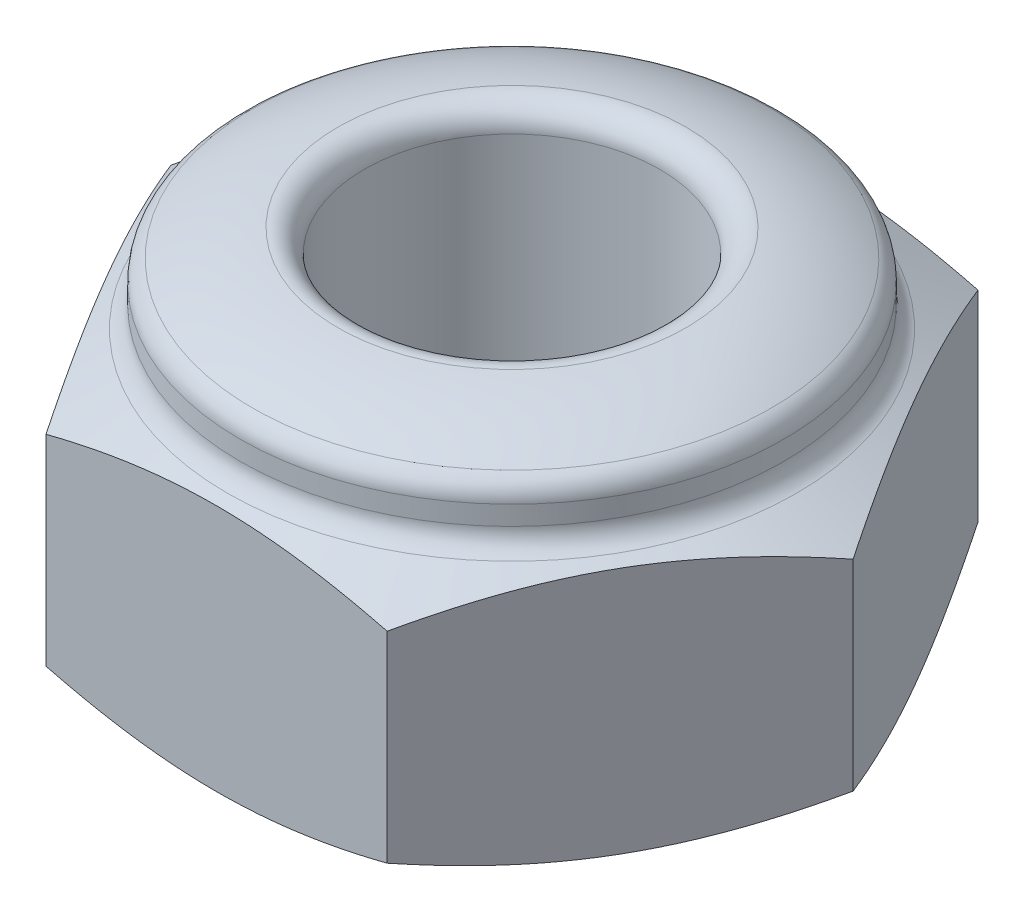
ISO-10303-21;
HEADER;
FILE_DESCRIPTION(('STEP AP214'),'2;1');
FILE_NAME('part.step','',(''),(''),'','','');
FILE_SCHEMA(('AUTOMOTIVE_DESIGN { 1 0 10303 214 1 1 1 1 }'));
ENDSEC;
DATA;
#1=APPLICATION_CONTEXT('core data for automotive mechanical design processes');
#2=APPLICATION_PROTOCOL_DEFINITION('international standard','automotive_design',2000,#1);
#3=PRODUCT_CONTEXT('',#1,'mechanical');
#4=PRODUCT('Part','Part','',(#3));
#5=PRODUCT_RELATED_PRODUCT_CATEGORY('part','',(#4));
#6=PRODUCT_DEFINITION_FORMATION('','',#4);
#7=PRODUCT_DEFINITION_CONTEXT('part definition',#1,'design');
#8=PRODUCT_DEFINITION('design','',#6,#7);
#9=PRODUCT_DEFINITION_SHAPE('','',#8);
#10=(LENGTH_UNIT() NAMED_UNIT(*) SI_UNIT(.MILLI.,.METRE.));
#11=(NAMED_UNIT(*) PLANE_ANGLE_UNIT() SI_UNIT($,.RADIAN.));
#12=(NAMED_UNIT(*) SI_UNIT($,.STERADIAN.) SOLID_ANGLE_UNIT());
#13=UNCERTAINTY_MEASURE_WITH_UNIT(LENGTH_MEASURE(1.E-05),#10,'distance_accuracy_value','');
#14=(GEOMETRIC_REPRESENTATION_CONTEXT(3) GLOBAL_UNCERTAINTY_ASSIGNED_CONTEXT((#13)) GLOBAL_UNIT_ASSIGNED_CONTEXT((#10,
#11,#12)) REPRESENTATION_CONTEXT('',''));
#15=CARTESIAN_POINT('',(0.,0.,0.));
#16=DIRECTION('',(0.,0.,1.));
#17=DIRECTION('',(1.,0.,0.));
#18=AXIS2_PLACEMENT_3D('',#15,#16,#17);
#19=CARTESIAN_POINT('',(0.,-1.15,0.));
#20=DIRECTION('',(0.,1.,0.));
#21=DIRECTION('',(0.,0.,1.));
#22=AXIS2_PLACEMENT_3D('',#19,#20,#21);
#23=PLANE('',#22);
#24=CARTESIAN_POINT('',(0.,-1.15,0.));
#25=DIRECTION('',(0.,1.,0.));
#26=DIRECTION('',(0.,0.,1.));
#27=AXIS2_PLACEMENT_3D('',#24,#25,#26);
#28=CIRCLE('',#27,1.25);
#29=CARTESIAN_POINT('',(0.,-1.15,1.25));
#30=VERTEX_POINT('',#29);
#31=EDGE_CURVE('E233',#30,#30,#28,.T.);
#32=ORIENTED_EDGE('',*,*,#31,.T.);
#33=EDGE_LOOP('',(#32));
#34=FACE_BOUND('',#33,.T.);
#35=CARTESIAN_POINT('',(0.,-1.15,0.));
#36=DIRECTION('',(0.,1.,0.));
#37=DIRECTION('',(0.,0.,1.));
#38=AXIS2_PLACEMENT_3D('',#35,#36,#37);
#39=CIRCLE('',#38,2.30000000000003);
#40=CARTESIAN_POINT('',(0.,-1.15,2.30000000000003));
#41=VERTEX_POINT('',#40);
#42=EDGE_CURVE('E236',#41,#41,#39,.T.);
#43=ORIENTED_EDGE('',*,*,#42,.F.);
#44=EDGE_LOOP('',(#43));
#45=FACE_BOUND('',#44,.T.);
#46=ADVANCED_FACE('F33',(#34,#45),#23,.F.);
#47=CARTESIAN_POINT('',(1.44337567297409,1.15,2.49999999999999));
#48=DIRECTION('',(-0.866025403784441,0.,-0.499999999999995));
#49=DIRECTION('',(-0.499999999999995,0.,0.866025403784442));
#50=AXIS2_PLACEMENT_3D('',#47,#48,#49);
#51=PLANE('',#50);
#52=DIRECTION('',(0.,-1.,0.));
#53=VECTOR('',#52,1.);
#54=CARTESIAN_POINT('',(1.44337567297409,1.15,2.49999999999999));
#55=LINE('',#54,#53);
#56=CARTESIAN_POINT('',(1.44337567297417,0.85,2.49999999999999));
#57=VERTEX_POINT('',#56);
#58=CARTESIAN_POINT('',(1.44337567297409,-0.850000000000019,2.49999999999999));
#59=VERTEX_POINT('',#58);
#60=EDGE_CURVE('E100',#57,#59,#55,.T.);
#61=ORIENTED_EDGE('',*,*,#60,.T.);
#62=CARTESIAN_POINT('',(1.44326020292026,-0.849940957792842,2.50019999999999));
#63=CARTESIAN_POINT('',(1.48304200436103,-0.870275913021248,2.43129589868794));
#64=CARTESIAN_POINT('',(1.52297171977333,-0.88943828497677,2.36213560286208));
#65=CARTESIAN_POINT('',(1.60315528144172,-0.925022276588077,2.22325360012059));
#66=CARTESIAN_POINT('',(1.64340928110925,-0.941442508167529,2.15353162748857));
#67=CARTESIAN_POINT('',(1.7647467778341,-0.98600599889985,1.9433689182979));
#68=CARTESIAN_POINT('',(1.84630037490682,-1.00939599507613,1.80211394462795));
#69=CARTESIAN_POINT('',(1.96821494245454,-1.03261787149011,1.5909517194525));
#70=CARTESIAN_POINT('',(2.008307412772,-1.03838013773711,1.52150952386173));
#71=CARTESIAN_POINT('',(2.08858324859441,-1.0460025287005,1.38246769759725));
#72=CARTESIAN_POINT('',(2.12876660075624,-1.0478631931826,1.31286809003452));
#73=CARTESIAN_POINT('',(2.20908795497129,-1.04760865942046,1.17374742360132));
#74=CARTESIAN_POINT('',(2.24922596105515,-1.04549755958155,1.10422635774957));
#75=CARTESIAN_POINT('',(2.32939940188051,-1.03738839638708,0.965361884822419));
#76=CARTESIAN_POINT('',(2.3694348448531,-1.03139065542793,0.896018463490371));
#77=CARTESIAN_POINT('',(2.44942482862501,-1.01570084263161,0.757471747500809));
#78=CARTESIAN_POINT('',(2.48937890672737,-1.0059994399089,0.688269254257944));
#79=CARTESIAN_POINT('',(2.56904987868748,-0.983213414244998,0.550275082934642));
#80=CARTESIAN_POINT('',(2.60876673138533,-0.970128220698126,0.481483476145227));
#81=CARTESIAN_POINT('',(2.68840407449965,-0.940762434342736,0.343547551691429));
#82=CARTESIAN_POINT('',(2.72832109885332,-0.924444659193758,0.274409237423899));
#83=CARTESIAN_POINT('',(2.80783255799786,-0.889116076286036,0.136691350401629));
#84=CARTESIAN_POINT('',(2.84742716860096,-0.870106856989903,0.0681114731311524));
#85=CARTESIAN_POINT('',(2.88686681600197,-0.849940957792858,-0.00020000000000055));
#86=B_SPLINE_CURVE_WITH_KNOTS('',3,(#62,#63,#64,#65,#66,#67,#68,#69,#70,#71,#72,#73,#74,#75,#76,
#77,#78,#79,#80,#81,#82,#83,#84,#85),.UNSPECIFIED.,.F.,.F.,(4,2,2,2,2,2,2,2,2,2,2,4),(0.,
0.246339561475915,0.492803444956308,0.986384137280997,1.22748103973818,1.46854458552913,
1.70935951780852,1.9501544770742,2.19156013413322,2.43300652579168,2.6774108286129,
2.9216714831912),.UNSPECIFIED.);
#87=CARTESIAN_POINT('',(2.88675134594818,-0.85,0.));
#88=VERTEX_POINT('',#87);
#89=EDGE_CURVE('E48',#59,#88,#86,.T.);
#90=ORIENTED_EDGE('',*,*,#89,.T.);
#91=DIRECTION('',(0.,-1.,0.));
#92=VECTOR('',#91,1.);
#93=CARTESIAN_POINT('',(2.88675134594813,1.15,0.));
#94=LINE('',#93,#92);
#95=CARTESIAN_POINT('',(2.88675134594818,0.85,0.));
#96=VERTEX_POINT('',#95);
#97=EDGE_CURVE('E98',#96,#88,#94,.T.);
#98=ORIENTED_EDGE('',*,*,#97,.F.);
#99=CARTESIAN_POINT('',(2.88686681600197,0.849940957792849,-0.00019999999999984));
#100=CARTESIAN_POINT('',(2.84708501456119,0.870275913021254,0.0687041013120405));
#101=CARTESIAN_POINT('',(2.8071552991489,0.889438284976776,0.137864397137907));
#102=CARTESIAN_POINT('',(2.72697173748051,0.925022276588082,0.27674639987939));
#103=CARTESIAN_POINT('',(2.68671773781298,0.941442508167534,0.346468372511408));
#104=CARTESIAN_POINT('',(2.56538024108813,0.986005998899853,0.556631081702078));
#105=CARTESIAN_POINT('',(2.48382664401541,1.00939599507613,0.697886055372031));
#106=CARTESIAN_POINT('',(2.36191207646768,1.03261787149011,0.909048280547479));
#107=CARTESIAN_POINT('',(2.32181960615023,1.03838013773711,0.978490476138252));
#108=CARTESIAN_POINT('',(2.24154377032782,1.0460025287005,1.11753230240273));
#109=CARTESIAN_POINT('',(2.20136041816599,1.0478631931826,1.18713190996545));
#110=CARTESIAN_POINT('',(2.12103906395094,1.04760865942046,1.32625257639866));
#111=CARTESIAN_POINT('',(2.08090105786708,1.04549755958155,1.39577364225041));
#112=CARTESIAN_POINT('',(2.00072761704172,1.03738839638707,1.53463811517756));
#113=CARTESIAN_POINT('',(1.96069217406913,1.03139065542793,1.6039815365096));
#114=CARTESIAN_POINT('',(1.88070219029722,1.01570084263161,1.74252825249917));
#115=CARTESIAN_POINT('',(1.84074811219486,1.0059994399089,1.81173074574203));
#116=CARTESIAN_POINT('',(1.76107714023475,0.983213414244995,1.94972491706534));
#117=CARTESIAN_POINT('',(1.7213602875369,0.970128220698123,2.01851652385475));
#118=CARTESIAN_POINT('',(1.64172294442258,0.940762434342732,2.15645244830855));
#119=CARTESIAN_POINT('',(1.6018059200689,0.924444659193753,2.22559076257608));
#120=CARTESIAN_POINT('',(1.52229446092437,0.88911607628603,2.36330864959836));
#121=CARTESIAN_POINT('',(1.48269985032127,0.870106856989896,2.43188852686883));
#122=CARTESIAN_POINT('',(1.44326020292026,0.849940957792851,2.50019999999999));
#123=B_SPLINE_CURVE_WITH_KNOTS('',3,(#99,#100,#101,#102,#103,#104,#105,#106,#107,#108,#109,#110,
#111,#112,#113,#114,#115,#116,#117,#118,#119,#120,#121,#122),.UNSPECIFIED.,.F.,.F.,(4,2,2,2,2,2,
2,2,2,2,2,4),(0.,0.246339561475913,0.492803444956304,0.98638413728099,1.22748103973818,
1.46854458552912,1.70935951780851,1.95015447707418,2.19156013413321,2.43300652579167,
2.6774108286129,2.9216714831912),.UNSPECIFIED.);
#124=EDGE_CURVE('E169',#96,#57,#123,.T.);
#125=ORIENTED_EDGE('',*,*,#124,.T.);
#126=EDGE_LOOP('',(#61,#90,#98,#125));
#127=FACE_BOUND('',#126,.T.);
#128=ADVANCED_FACE('F96',(#127),#51,.F.);
#129=CARTESIAN_POINT('',(2.88675134594813,1.15,0.));
#130=DIRECTION('',(-0.866025403784438,0.,0.500000000000001));
#131=DIRECTION('',(0.500000000000001,0.,0.866025403784438));
#132=AXIS2_PLACEMENT_3D('',#129,#130,#131);
#133=PLANE('',#132);
#134=ORIENTED_EDGE('',*,*,#97,.T.);
#135=CARTESIAN_POINT('',(2.88686681600197,-0.849940957792849,0.000200000000000056));
#136=CARTESIAN_POINT('',(2.84708501456119,-0.870275913021255,-0.0687041013120404));
#137=CARTESIAN_POINT('',(2.80715529914889,-0.889438284976777,-0.137864397137907));
#138=CARTESIAN_POINT('',(2.7269717374805,-0.925022276588083,-0.27674639987939));
#139=CARTESIAN_POINT('',(2.68671773781298,-0.941442508167536,-0.346468372511408));
#140=CARTESIAN_POINT('',(2.56538024108812,-0.986005998899856,-0.556631081702077));
#141=CARTESIAN_POINT('',(2.4838266440154,-1.00939599507614,-0.69788605537203));
#142=CARTESIAN_POINT('',(2.36191207646768,-1.03261787149012,-0.909048280547477));
#143=CARTESIAN_POINT('',(2.32181960615023,-1.03838013773711,-0.97849047613825));
#144=CARTESIAN_POINT('',(2.24154377032781,-1.0460025287005,-1.11753230240273));
#145=CARTESIAN_POINT('',(2.20136041816598,-1.0478631931826,-1.18713190996545));
#146=CARTESIAN_POINT('',(2.12103906395093,-1.04760865942047,-1.32625257639865));
#147=CARTESIAN_POINT('',(2.08090105786707,-1.04549755958156,-1.39577364225041));
#148=CARTESIAN_POINT('',(2.00072761704171,-1.03738839638708,-1.53463811517755));
#149=CARTESIAN_POINT('',(1.96069217406912,-1.03139065542794,-1.6039815365096));
#150=CARTESIAN_POINT('',(1.88070219029721,-1.01570084263161,-1.74252825249916));
#151=CARTESIAN_POINT('',(1.84074811219484,-1.00599943990891,-1.81173074574203));
#152=CARTESIAN_POINT('',(1.76107714023473,-0.983213414245,-1.94972491706534));
#153=CARTESIAN_POINT('',(1.72136028753688,-0.970128220698128,-2.01851652385476));
#154=CARTESIAN_POINT('',(1.64172294442255,-0.940762434342736,-2.15645244830856));
#155=CARTESIAN_POINT('',(1.60180592006888,-0.924444659193756,-2.2255907625761));
#156=CARTESIAN_POINT('',(1.52229446092434,-0.889116076286032,-2.36330864959837));
#157=CARTESIAN_POINT('',(1.48269985032123,-0.870106856989897,-2.43188852686885));
#158=CARTESIAN_POINT('',(1.44326020292022,-0.849940957792851,-2.50020000000001));
#159=B_SPLINE_CURVE_WITH_KNOTS('',3,(#135,#136,#137,#138,#139,#140,#141,#142,#143,#144,#145,
#146,#147,#148,#149,#150,#151,#152,#153,#154,#155,#156,#157,#158),.UNSPECIFIED.,.F.,.F.,(4,2,2,
2,2,2,2,2,2,2,2,4),(0.,0.246339561475914,0.492803444956306,0.986384137280993,1.22748103973818,
1.46854458552913,1.70935951780852,1.95015447707419,2.19156013413323,2.43300652579169,
2.67741082861292,2.92167148319123),.UNSPECIFIED.);
#160=CARTESIAN_POINT('',(1.44337567297414,-0.85,-2.50000000000001));
#161=VERTEX_POINT('',#160);
#162=EDGE_CURVE('E84',#88,#161,#159,.T.);
#163=ORIENTED_EDGE('',*,*,#162,.T.);
#164=DIRECTION('',(0.,-1.,0.));
#165=VECTOR('',#164,1.);
#166=CARTESIAN_POINT('',(1.44337567297406,1.15,-2.50000000000001));
#167=LINE('',#166,#165);
#168=CARTESIAN_POINT('',(1.44337567297414,0.85,-2.50000000000001));
#169=VERTEX_POINT('',#168);
#170=EDGE_CURVE('E106',#169,#161,#167,.T.);
#171=ORIENTED_EDGE('',*,*,#170,.F.);
#172=CARTESIAN_POINT('',(1.44326020292022,0.849940957792842,-2.50020000000001));
#173=CARTESIAN_POINT('',(1.483042004361,0.870275913021248,-2.43129589868796));
#174=CARTESIAN_POINT('',(1.5229717197733,0.889438284976771,-2.3621356028621));
#175=CARTESIAN_POINT('',(1.60315528144169,0.925022276588078,-2.22325360012061));
#176=CARTESIAN_POINT('',(1.64340928110921,0.941442508167531,-2.1535316274886));
#177=CARTESIAN_POINT('',(1.76474677783407,0.986005998899852,-1.94336891829792));
#178=CARTESIAN_POINT('',(1.84630037490679,1.00939599507613,-1.80211394462797));
#179=CARTESIAN_POINT('',(1.96821494245452,1.03261787149012,-1.59095171945252));
#180=CARTESIAN_POINT('',(2.00830741277197,1.03838013773711,-1.52150952386175));
#181=CARTESIAN_POINT('',(2.08858324859438,1.0460025287005,-1.38246769759727));
#182=CARTESIAN_POINT('',(2.12876660075621,1.0478631931826,-1.31286809003455));
#183=CARTESIAN_POINT('',(2.20908795497126,1.04760865942047,-1.17374742360134));
#184=CARTESIAN_POINT('',(2.24922596105513,1.04549755958156,-1.10422635774959));
#185=CARTESIAN_POINT('',(2.32939940188049,1.03738839638708,-0.965361884822442));
#186=CARTESIAN_POINT('',(2.36943484485308,1.03139065542794,-0.896018463490393));
#187=CARTESIAN_POINT('',(2.44942482862499,1.01570084263161,-0.75747174750083));
#188=CARTESIAN_POINT('',(2.48937890672735,1.00599943990891,-0.688269254257963));
#189=CARTESIAN_POINT('',(2.56904987868746,0.983213414245003,-0.550275082934656));
#190=CARTESIAN_POINT('',(2.60876673138532,0.970128220698131,-0.481483476145239));
#191=CARTESIAN_POINT('',(2.68840407449964,0.94076243434274,-0.343547551691438));
#192=CARTESIAN_POINT('',(2.72832109885332,0.924444659193761,-0.274409237423906));
#193=CARTESIAN_POINT('',(2.80783255799785,0.889116076286038,-0.136691350401632));
#194=CARTESIAN_POINT('',(2.84742716860096,0.870106856989903,-0.0681114731311541));
#195=CARTESIAN_POINT('',(2.88686681600197,0.849940957792858,0.000200000000000967));
#196=B_SPLINE_CURVE_WITH_KNOTS('',3,(#172,#173,#174,#175,#176,#177,#178,#179,#180,#181,#182,
#183,#184,#185,#186,#187,#188,#189,#190,#191,#192,#193,#194,#195),.UNSPECIFIED.,.F.,.F.,(4,2,2,
2,2,2,2,2,2,2,2,4),(0.,0.246339561475916,0.492803444956309,0.986384137281,1.22748103973819,
1.46854458552914,1.70935951780853,1.9501544770742,2.19156013413324,2.4330065257917,
2.67741082861293,2.92167148319123),.UNSPECIFIED.);
#197=EDGE_CURVE('E104',#169,#96,#196,.T.);
#198=ORIENTED_EDGE('',*,*,#197,.T.);
#199=EDGE_LOOP('',(#134,#163,#171,#198));
#200=FACE_BOUND('',#199,.T.);
#201=ADVANCED_FACE('F103',(#200),#133,.F.);
#202=CARTESIAN_POINT('',(1.44337567297406,1.15,-2.50000000000001));
#203=DIRECTION('',(0.,0.,1.));
#204=DIRECTION('',(1.,0.,0.));
#205=AXIS2_PLACEMENT_3D('',#202,#203,#204);
#206=PLANE('',#205);
#207=ORIENTED_EDGE('',*,*,#170,.T.);
#208=CARTESIAN_POINT('',(4.34587361311277,0.237458154811676,-2.50000000000002));
#209=CARTESIAN_POINT('',(4.22613575360741,0.184404104682634,-2.50000000000001));
#210=CARTESIAN_POINT('',(4.1062025547838,0.13178444358232,-2.50000000000001));
#211=CARTESIAN_POINT('',(3.86583750401857,0.0276642732761254,-2.50000000000001));
#212=CARTESIAN_POINT('',(3.74540560322869,-0.023836123054455,-2.50000000000001));
#213=CARTESIAN_POINT('',(3.50360609912637,-0.125605239165463,-2.50000000000001));
#214=CARTESIAN_POINT('',(3.38223678932978,-0.175869916174756,-2.50000000000001));
#215=CARTESIAN_POINT('',(3.13879002351803,-0.274648468388736,-2.50000000000001));
#216=CARTESIAN_POINT('',(3.01671258916653,-0.323162396829636,-2.50000000000001));
#217=CARTESIAN_POINT('',(2.77143659534895,-0.418066296864358,-2.50000000000001));
#218=CARTESIAN_POINT('',(2.64823622181114,-0.464451601579476,-2.50000000000001));
#219=CARTESIAN_POINT('',(2.40079325665039,-0.554347350801867,-2.50000000000001));
#220=CARTESIAN_POINT('',(2.27655072122877,-0.597857949226153,-2.50000000000001));
#221=CARTESIAN_POINT('',(2.0268930920685,-0.681126486381562,-2.50000000000001));
#222=CARTESIAN_POINT('',(1.90147883876774,-0.720886917245262,-2.50000000000001));
#223=CARTESIAN_POINT('',(1.64923272914206,-0.795561558144086,-2.50000000000001));
#224=CARTESIAN_POINT('',(1.52240109352089,-0.830476511624052,-2.50000000000001));
#225=CARTESIAN_POINT('',(1.2279112141293,-0.903829645269126,-2.5));
#226=CARTESIAN_POINT('',(1.05967649430544,-0.940057046103863,-2.5));
#227=CARTESIAN_POINT('',(0.805529635896037,-0.983646986111996,-2.5));
#228=CARTESIAN_POINT('',(0.720530950577388,-0.996383728491125,-2.5));
#229=CARTESIAN_POINT('',(0.550033961713094,-1.01785212074504,-2.5));
#230=CARTESIAN_POINT('',(0.464535739119156,-1.02658440227139,-2.5));
#231=CARTESIAN_POINT('',(0.293370556151716,-1.03969684893678,-2.5));
#232=CARTESIAN_POINT('',(0.207704250443258,-1.04408547196346,-2.5));
#233=CARTESIAN_POINT('',(0.0362589448771357,-1.04835730536555,-2.5));
#234=CARTESIAN_POINT('',(-0.0495200535257338,-1.04824057334186,-2.5));
#235=CARTESIAN_POINT('',(-0.220939893356359,-1.04350621120751,-2.5));
#236=CARTESIAN_POINT('',(-0.306580753705786,-1.03888926136928,-2.5));
#237=CARTESIAN_POINT('',(-0.477525824997255,-1.02535045311828,-2.5));
#238=CARTESIAN_POINT('',(-0.562829987274483,-1.01642799383534,-2.5));
#239=CARTESIAN_POINT('',(-0.807043784518116,-0.985097564079737,-2.5));
#240=CARTESIAN_POINT('',(-0.965323989872185,-0.957713331320902,-2.5));
#241=CARTESIAN_POINT('',(-1.27958845813876,-0.891920978802273,-2.5));
#242=CARTESIAN_POINT('',(-1.43557113320953,-0.853505579534545,-2.5));
#243=CARTESIAN_POINT('',(-1.74604098127096,-0.768300675878605,-2.49999999999999));
#244=CARTESIAN_POINT('',(-1.90051660451126,-0.721469811212012,-2.49999999999999));
#245=CARTESIAN_POINT('',(-2.20746583561587,-0.621840584460346,-2.49999999999999));
#246=CARTESIAN_POINT('',(-2.35993986726562,-0.569043509076389,-2.49999999999999));
#247=CARTESIAN_POINT('',(-2.66794333182038,-0.457430195575799,-2.49999999999999));
#248=CARTESIAN_POINT('',(-2.82342352420293,-0.398479223604534,-2.49999999999999));
#249=CARTESIAN_POINT('',(-3.13307330231513,-0.277214585109686,-2.49999999999999));
#250=CARTESIAN_POINT('',(-3.28724277773182,-0.214900638730755,-2.49999999999999));
#251=CARTESIAN_POINT('',(-3.59261725095966,-0.0885892425457314,-2.49999999999999));
#252=CARTESIAN_POINT('',(-3.74383514731852,-0.0246228195387622,-2.49999999999999));
#253=CARTESIAN_POINT('',(-4.04542645331375,0.105162342831155,-2.49999999999999));
#254=CARTESIAN_POINT('',(-4.19580008175662,0.170980572904022,-2.49999999999999));
#255=CARTESIAN_POINT('',(-4.34587361311278,0.237458154811699,-2.49999999999999));
#256=B_SPLINE_CURVE_WITH_KNOTS('',3,(#208,#209,#210,#211,#212,#213,#214,#215,#216,#217,#218,
#219,#220,#221,#222,#223,#224,#225,#226,#227,#228,#229,#230,#231,#232,#233,#234,#235,#236,#237,
#238,#239,#240,#241,#242,#243,#244,#245,#246,#247,#248,#249,#250,#251,#252,#253,#254,#255),
.UNSPECIFIED.,.F.,.F.,(4,2,2,2,2,2,2,2,2,2,2,2,2,2,2,2,2,2,2,2,2,2,2,4),(0.,0.392898697877062,
0.785836836535172,1.17992419086486,1.57399955179503,1.9689012219793,2.3637817312452,
2.75839795034677,3.15295355612053,3.66867539781896,3.92643992380949,4.18416377680482,
4.44138480178148,4.69860253819164,4.95578139848303,5.21299616063957,5.69432918948238,
6.17598058462,6.66006737935727,7.14404997218841,7.64283974963129,8.14167109886691,
8.63422918349652,9.1266531024332),.UNSPECIFIED.);
#257=CARTESIAN_POINT('',(-1.44337567297407,-0.85,-2.50000000000002));
#258=VERTEX_POINT('',#257);
#259=EDGE_CURVE('E87',#161,#258,#256,.T.);
#260=ORIENTED_EDGE('',*,*,#259,.T.);
#261=DIRECTION('',(0.,-1.,0.));
#262=VECTOR('',#261,1.);
#263=CARTESIAN_POINT('',(-1.44337567297408,1.15,-2.5));
#264=LINE('',#263,#262);
#265=CARTESIAN_POINT('',(-1.44337567297407,0.85,-2.50000000000002));
#266=VERTEX_POINT('',#265);
#267=EDGE_CURVE('E110',#266,#258,#264,.T.);
#268=ORIENTED_EDGE('',*,*,#267,.F.);
#269=CARTESIAN_POINT('',(-4.34587361311278,-0.2374581548117,-2.49999999999999));
#270=CARTESIAN_POINT('',(-4.22613575360743,-0.184404104682657,-2.49999999999999));
#271=CARTESIAN_POINT('',(-4.10620255478381,-0.131784443582342,-2.49999999999999));
#272=CARTESIAN_POINT('',(-3.86583750401859,-0.027664273276146,-2.49999999999999));
#273=CARTESIAN_POINT('',(-3.7454056032287,0.0238361230544352,-2.49999999999999));
#274=CARTESIAN_POINT('',(-3.50360609912638,0.125605239165444,-2.49999999999999));
#275=CARTESIAN_POINT('',(-3.38223678932979,0.175869916174738,-2.49999999999999));
#276=CARTESIAN_POINT('',(-3.13879002351804,0.274648468388719,-2.49999999999999));
#277=CARTESIAN_POINT('',(-3.01671258916654,0.32316239682962,-2.49999999999999));
#278=CARTESIAN_POINT('',(-2.77143659534896,0.418066296864343,-2.49999999999999));
#279=CARTESIAN_POINT('',(-2.64823622181114,0.464451601579462,-2.49999999999999));
#280=CARTESIAN_POINT('',(-2.40079325665039,0.554347350801855,-2.49999999999999));
#281=CARTESIAN_POINT('',(-2.27655072122877,0.597857949226141,-2.49999999999999));
#282=CARTESIAN_POINT('',(-2.0268930920685,0.681126486381552,-2.49999999999999));
#283=CARTESIAN_POINT('',(-1.90147883876773,0.720886917245252,-2.49999999999999));
#284=CARTESIAN_POINT('',(-1.64923272914205,0.795561558144078,-2.49999999999999));
#285=CARTESIAN_POINT('',(-1.52240109352088,0.830476511624044,-2.49999999999999));
#286=CARTESIAN_POINT('',(-1.22791121412929,0.90382964526912,-2.5));
#287=CARTESIAN_POINT('',(-1.05967649430544,0.940057046103858,-2.5));
#288=CARTESIAN_POINT('',(-0.805529635896028,0.983646986111992,-2.5));
#289=CARTESIAN_POINT('',(-0.720530950577378,0.996383728491121,-2.5));
#290=CARTESIAN_POINT('',(-0.550033961713084,1.01785212074504,-2.5));
#291=CARTESIAN_POINT('',(-0.464535739119146,1.02658440227138,-2.5));
#292=CARTESIAN_POINT('',(-0.293370556151706,1.03969684893678,-2.5));
#293=CARTESIAN_POINT('',(-0.207704250443248,1.04408547196346,-2.5));
#294=CARTESIAN_POINT('',(-0.0362589448771249,1.04835730536555,-2.5));
#295=CARTESIAN_POINT('',(0.0495200535257452,1.04824057334186,-2.5));
#296=CARTESIAN_POINT('',(0.220939893356371,1.04350621120751,-2.5));
#297=CARTESIAN_POINT('',(0.306580753705797,1.03888926136928,-2.5));
#298=CARTESIAN_POINT('',(0.477525824997267,1.02535045311829,-2.5));
#299=CARTESIAN_POINT('',(0.562829987274496,1.01642799383534,-2.5));
#300=CARTESIAN_POINT('',(0.807043784518127,0.98509756407974,-2.5));
#301=CARTESIAN_POINT('',(0.965323989872195,0.957713331320907,-2.5));
#302=CARTESIAN_POINT('',(1.27958845813877,0.891920978802278,-2.5));
#303=CARTESIAN_POINT('',(1.43557113320954,0.853505579534552,-2.50000000000001));
#304=CARTESIAN_POINT('',(1.74604098127096,0.768300675878613,-2.50000000000001));
#305=CARTESIAN_POINT('',(1.90051660451126,0.721469811212021,-2.50000000000001));
#306=CARTESIAN_POINT('',(2.20746583561587,0.621840584460357,-2.50000000000001));
#307=CARTESIAN_POINT('',(2.35993986726562,0.569043509076401,-2.50000000000001));
#308=CARTESIAN_POINT('',(2.66794333182038,0.457430195575813,-2.50000000000001));
#309=CARTESIAN_POINT('',(2.82342352420292,0.398479223604548,-2.50000000000001));
#310=CARTESIAN_POINT('',(3.13307330231512,0.277214585109702,-2.50000000000001));
#311=CARTESIAN_POINT('',(3.28724277773182,0.214900638730772,-2.50000000000001));
#312=CARTESIAN_POINT('',(3.59261725095965,0.0885892425457498,-2.50000000000001));
#313=CARTESIAN_POINT('',(3.74383514731851,0.0246228195387814,-2.50000000000001));
#314=CARTESIAN_POINT('',(4.04542645331373,-0.105162342831134,-2.50000000000001));
#315=CARTESIAN_POINT('',(4.19580008175661,-0.170980572904,-2.50000000000001));
#316=CARTESIAN_POINT('',(4.34587361311277,-0.237458154811677,-2.50000000000002));
#317=B_SPLINE_CURVE_WITH_KNOTS('',3,(#269,#270,#271,#272,#273,#274,#275,#276,#277,#278,#279,
#280,#281,#282,#283,#284,#285,#286,#287,#288,#289,#290,#291,#292,#293,#294,#295,#296,#297,#298,
#299,#300,#301,#302,#303,#304,#305,#306,#307,#308,#309,#310,#311,#312,#313,#314,#315,#316),
.UNSPECIFIED.,.F.,.F.,(4,2,2,2,2,2,2,2,2,2,2,2,2,2,2,2,2,2,2,2,2,2,2,4),(0.,0.392898697877065,
0.785836836535179,1.17992419086487,1.57399955179504,1.96890122197932,2.36378173124523,
2.7583979503468,3.15295355612056,3.66867539781899,3.92643992380953,4.18416377680485,
4.44138480178152,4.69860253819167,4.95578139848306,5.21299616063961,5.69432918948241,
6.17598058462002,6.66006737935729,7.14404997218843,7.6428397496313,8.14167109886692,
8.63422918349653,9.1266531024332),.UNSPECIFIED.);
#318=EDGE_CURVE('E157',#266,#169,#317,.T.);
#319=ORIENTED_EDGE('',*,*,#318,.T.);
#320=EDGE_LOOP('',(#207,#260,#268,#319));
#321=FACE_BOUND('',#320,.T.);
#322=ADVANCED_FACE('F178',(#321),#206,.F.);
#323=CARTESIAN_POINT('',(-1.44337567297408,1.15,-2.5));
#324=DIRECTION('',(0.866025403784442,0.,0.499999999999995));
#325=DIRECTION('',(0.499999999999995,0.,-0.866025403784442));
#326=AXIS2_PLACEMENT_3D('',#323,#324,#325);
#327=PLANE('',#326);
#328=ORIENTED_EDGE('',*,*,#267,.T.);
#329=CARTESIAN_POINT('',(-1.44326020292024,-0.849940957792829,-2.5002));
#330=CARTESIAN_POINT('',(-1.48304200436101,-0.870275913021235,-2.43129589868795));
#331=CARTESIAN_POINT('',(-1.52297171977331,-0.889438284976756,-2.36213560286209));
#332=CARTESIAN_POINT('',(-1.6031552814417,-0.925022276588063,-2.2232536001206));
#333=CARTESIAN_POINT('',(-1.64340928110923,-0.941442508167515,-2.15353162748858));
#334=CARTESIAN_POINT('',(-1.76474677783408,-0.986005998899835,-1.94336891829791));
#335=CARTESIAN_POINT('',(-1.8463003749068,-1.00939599507612,-1.80211394462796));
#336=CARTESIAN_POINT('',(-1.96821494245453,-1.0326178714901,-1.59095171945251));
#337=CARTESIAN_POINT('',(-2.00830741277198,-1.03838013773709,-1.52150952386173));
#338=CARTESIAN_POINT('',(-2.0885832485944,-1.04600252870048,-1.38246769759725));
#339=CARTESIAN_POINT('',(-2.12876660075623,-1.04786319318258,-1.31286809003453));
#340=CARTESIAN_POINT('',(-2.20908795497127,-1.04760865942044,-1.17374742360132));
#341=CARTESIAN_POINT('',(-2.24922596105514,-1.04549755958153,-1.10422635774957));
#342=CARTESIAN_POINT('',(-2.3293994018805,-1.03738839638706,-0.965361884822421));
#343=CARTESIAN_POINT('',(-2.36943484485308,-1.03139065542791,-0.896018463490372));
#344=CARTESIAN_POINT('',(-2.449424828625,-1.01570084263159,-0.757471747500809));
#345=CARTESIAN_POINT('',(-2.48937890672736,-1.00599943990888,-0.688269254257942));
#346=CARTESIAN_POINT('',(-2.56904987868747,-0.983213414244977,-0.550275082934636));
#347=CARTESIAN_POINT('',(-2.60876673138532,-0.970128220698105,-0.481483476145219));
#348=CARTESIAN_POINT('',(-2.68840407449965,-0.940762434342714,-0.343547551691417));
#349=CARTESIAN_POINT('',(-2.72832109885332,-0.924444659193734,-0.274409237423886));
#350=CARTESIAN_POINT('',(-2.80783255799786,-0.889116076286011,-0.136691350401612));
#351=CARTESIAN_POINT('',(-2.84742716860096,-0.870106856989876,-0.068111473131134));
#352=CARTESIAN_POINT('',(-2.88686681600197,-0.849940957792832,0.000200000000020978));
#353=B_SPLINE_CURVE_WITH_KNOTS('',3,(#329,#330,#331,#332,#333,#334,#335,#336,#337,#338,#339,
#340,#341,#342,#343,#344,#345,#346,#347,#348,#349,#350,#351,#352),.UNSPECIFIED.,.F.,.F.,(4,2,2,
2,2,2,2,2,2,2,2,4),(0.,0.246339561475916,0.49280344495631,0.986384137281002,1.22748103973819,
1.46854458552914,1.70935951780853,1.9501544770742,2.19156013413324,2.4330065257917,
2.67741082861293,2.92167148319123),.UNSPECIFIED.);
#354=CARTESIAN_POINT('',(-2.88675134594813,-0.85,0.));
#355=VERTEX_POINT('',#354);
#356=EDGE_CURVE('E197',#258,#355,#353,.T.);
#357=ORIENTED_EDGE('',*,*,#356,.T.);
#358=DIRECTION('',(0.,-1.,0.));
#359=VECTOR('',#358,1.);
#360=CARTESIAN_POINT('',(-2.88675134594813,1.15,0.));
#361=LINE('',#360,#359);
#362=CARTESIAN_POINT('',(-2.88675134594813,0.85,0.));
#363=VERTEX_POINT('',#362);
#364=EDGE_CURVE('E243',#363,#355,#361,.T.);
#365=ORIENTED_EDGE('',*,*,#364,.F.);
#366=CARTESIAN_POINT('',(-2.88686681600197,0.849940957792822,0.000200000000020158));
#367=CARTESIAN_POINT('',(-2.84708501456119,0.870275913021229,-0.0687041013120217));
#368=CARTESIAN_POINT('',(-2.80715529914889,0.889438284976751,-0.13786439713789));
#369=CARTESIAN_POINT('',(-2.7269717374805,0.925022276588058,-0.276746399879375));
#370=CARTESIAN_POINT('',(-2.68671773781298,0.941442508167511,-0.346468372511395));
#371=CARTESIAN_POINT('',(-2.56538024108812,0.986005998899831,-0.556631081702068));
#372=CARTESIAN_POINT('',(-2.4838266440154,1.00939599507611,-0.697886055372024));
#373=CARTESIAN_POINT('',(-2.36191207646767,1.0326178714901,-0.909048280547476));
#374=CARTESIAN_POINT('',(-2.32181960615022,1.03838013773709,-0.978490476138251));
#375=CARTESIAN_POINT('',(-2.24154377032781,1.04600252870048,-1.11753230240273));
#376=CARTESIAN_POINT('',(-2.20136041816598,1.04786319318258,-1.18713190996546));
#377=CARTESIAN_POINT('',(-2.12103906395093,1.04760865942044,-1.32625257639866));
#378=CARTESIAN_POINT('',(-2.08090105786707,1.04549755958154,-1.39577364225042));
#379=CARTESIAN_POINT('',(-2.0007276170417,1.03738839638706,-1.53463811517756));
#380=CARTESIAN_POINT('',(-1.96069217406912,1.03139065542791,-1.60398153650961));
#381=CARTESIAN_POINT('',(-1.8807021902972,1.01570084263159,-1.74252825249918));
#382=CARTESIAN_POINT('',(-1.84074811219484,1.00599943990888,-1.81173074574204));
#383=CARTESIAN_POINT('',(-1.76107714023474,0.98321341424498,-1.94972491706535));
#384=CARTESIAN_POINT('',(-1.72136028753688,0.970128220698107,-2.01851652385476));
#385=CARTESIAN_POINT('',(-1.64172294442256,0.940762434342717,-2.15645244830856));
#386=CARTESIAN_POINT('',(-1.60180592006888,0.924444659193738,-2.22559076257609));
#387=CARTESIAN_POINT('',(-1.52229446092435,0.889116076286017,-2.36330864959837));
#388=CARTESIAN_POINT('',(-1.48269985032125,0.870106856989882,-2.43188852686884));
#389=CARTESIAN_POINT('',(-1.44326020292024,0.849940957792838,-2.5002));
#390=B_SPLINE_CURVE_WITH_KNOTS('',3,(#366,#367,#368,#369,#370,#371,#372,#373,#374,#375,#376,
#377,#378,#379,#380,#381,#382,#383,#384,#385,#386,#387,#388,#389),.UNSPECIFIED.,.F.,.F.,(4,2,2,
2,2,2,2,2,2,2,2,4),(0.,0.246339561475918,0.492803444956314,0.986384137281009,1.2274810397382,
1.46854458552915,1.70935951780854,1.95015447707422,2.19156013413325,2.43300652579171,
2.67741082861293,2.92167148319123),.UNSPECIFIED.);
#391=EDGE_CURVE('E150',#363,#266,#390,.T.);
#392=ORIENTED_EDGE('',*,*,#391,.T.);
#393=EDGE_LOOP('',(#328,#357,#365,#392));
#394=FACE_BOUND('',#393,.T.);
#395=ADVANCED_FACE('F210',(#394),#327,.F.);
#396=CARTESIAN_POINT('',(-2.88675134594813,1.15,0.));
#397=DIRECTION('',(0.866025403784435,0.,-0.500000000000007));
#398=DIRECTION('',(-0.500000000000007,0.,-0.866025403784435));
#399=AXIS2_PLACEMENT_3D('',#396,#397,#398);
#400=PLANE('',#399);
#401=ORIENTED_EDGE('',*,*,#364,.T.);
#402=CARTESIAN_POINT('',(-2.88686681600197,-0.849940957792822,-0.000199999999979888));
#403=CARTESIAN_POINT('',(-2.84708501456119,-0.870275913021229,0.0687041013120613));
#404=CARTESIAN_POINT('',(-2.80715529914889,-0.889438284976751,0.137864397137929));
#405=CARTESIAN_POINT('',(-2.7269717374805,-0.925022276588058,0.276746399879414));
#406=CARTESIAN_POINT('',(-2.68671773781297,-0.941442508167511,0.346468372511432));
#407=CARTESIAN_POINT('',(-2.56538024108811,-0.986005998899832,0.556631081702105));
#408=CARTESIAN_POINT('',(-2.48382664401539,-1.00939599507611,0.697886055372059));
#409=CARTESIAN_POINT('',(-2.36191207646766,-1.0326178714901,0.909048280547509));
#410=CARTESIAN_POINT('',(-2.32181960615021,-1.03838013773709,0.978490476138283));
#411=CARTESIAN_POINT('',(-2.24154377032779,-1.04600252870048,1.11753230240276));
#412=CARTESIAN_POINT('',(-2.20136041816596,-1.04786319318258,1.18713190996549));
#413=CARTESIAN_POINT('',(-2.12103906395091,-1.04760865942044,1.32625257639869));
#414=CARTESIAN_POINT('',(-2.08090105786705,-1.04549755958153,1.39577364225045));
#415=CARTESIAN_POINT('',(-2.00072761704168,-1.03738839638706,1.53463811517759));
#416=CARTESIAN_POINT('',(-1.96069217406909,-1.03139065542791,1.60398153650964));
#417=CARTESIAN_POINT('',(-1.88070219029718,-1.01570084263159,1.7425282524992));
#418=CARTESIAN_POINT('',(-1.84074811219482,-1.00599943990888,1.81173074574207));
#419=CARTESIAN_POINT('',(-1.76107714023471,-0.983213414244979,1.94972491706537));
#420=CARTESIAN_POINT('',(-1.72136028753685,-0.970128220698107,2.01851652385479));
#421=CARTESIAN_POINT('',(-1.64172294442253,-0.940762434342717,2.15645244830859));
#422=CARTESIAN_POINT('',(-1.60180592006885,-0.924444659193738,2.22559076257612));
#423=CARTESIAN_POINT('',(-1.52229446092432,-0.889116076286017,2.36330864959839));
#424=CARTESIAN_POINT('',(-1.48269985032122,-0.870106856989883,2.43188852686886));
#425=CARTESIAN_POINT('',(-1.4432602029202,-0.849940957792838,2.50020000000002));
#426=B_SPLINE_CURVE_WITH_KNOTS('',3,(#402,#403,#404,#405,#406,#407,#408,#409,#410,#411,#412,
#413,#414,#415,#416,#417,#418,#419,#420,#421,#422,#423,#424,#425),.UNSPECIFIED.,.F.,.F.,(4,2,2,
2,2,2,2,2,2,2,2,4),(0.,0.246339561475918,0.492803444956314,0.98638413728101,1.2274810397382,
1.46854458552915,1.70935951780855,1.95015447707422,2.19156013413325,2.43300652579171,
2.67741082861293,2.92167148319123),.UNSPECIFIED.);
#427=CARTESIAN_POINT('',(-1.44337567297407,-0.85,2.50000000000002));
#428=VERTEX_POINT('',#427);
#429=EDGE_CURVE('E204',#355,#428,#426,.T.);
#430=ORIENTED_EDGE('',*,*,#429,.T.);
#431=DIRECTION('',(0.,-1.,0.));
#432=VECTOR('',#431,1.);
#433=CARTESIAN_POINT('',(-1.44337567297404,1.15,2.50000000000002));
#434=LINE('',#433,#432);
#435=CARTESIAN_POINT('',(-1.44337567297404,0.850000000000006,2.50000000000002));
#436=VERTEX_POINT('',#435);
#437=EDGE_CURVE('E241',#436,#428,#434,.T.);
#438=ORIENTED_EDGE('',*,*,#437,.F.);
#439=CARTESIAN_POINT('',(-1.4432602029202,0.849940957792829,2.50020000000002));
#440=CARTESIAN_POINT('',(-1.48304200436098,0.870275913021235,2.43129589868797));
#441=CARTESIAN_POINT('',(-1.52297171977328,0.889438284976757,2.36213560286211));
#442=CARTESIAN_POINT('',(-1.60315528144167,0.925022276588063,2.22325360012062));
#443=CARTESIAN_POINT('',(-1.6434092811092,0.941442508167515,2.15353162748861));
#444=CARTESIAN_POINT('',(-1.76474677783406,0.986005998899835,1.94336891829794));
#445=CARTESIAN_POINT('',(-1.84630037490678,1.00939599507612,1.80211394462798));
#446=CARTESIAN_POINT('',(-1.96821494245451,1.0326178714901,1.59095171945253));
#447=CARTESIAN_POINT('',(-2.00830741277196,1.03838013773709,1.52150952386176));
#448=CARTESIAN_POINT('',(-2.08858324859438,1.04600252870048,1.38246769759728));
#449=CARTESIAN_POINT('',(-2.12876660075621,1.04786319318258,1.31286809003456));
#450=CARTESIAN_POINT('',(-2.20908795497126,1.04760865942044,1.17374742360135));
#451=CARTESIAN_POINT('',(-2.24922596105512,1.04549755958153,1.1042263577496));
#452=CARTESIAN_POINT('',(-2.32939940188048,1.03738839638706,0.965361884822452));
#453=CARTESIAN_POINT('',(-2.36943484485307,1.03139065542791,0.896018463490404));
#454=CARTESIAN_POINT('',(-2.44942482862499,1.01570084263159,0.757471747500841));
#455=CARTESIAN_POINT('',(-2.48937890672735,1.00599943990888,0.688269254257975));
#456=CARTESIAN_POINT('',(-2.56904987868746,0.983213414244977,0.55027508293467));
#457=CARTESIAN_POINT('',(-2.60876673138532,0.970128220698104,0.481483476145254));
#458=CARTESIAN_POINT('',(-2.68840407449964,0.940762434342713,0.343547551691454));
#459=CARTESIAN_POINT('',(-2.72832109885332,0.924444659193734,0.274409237423924));
#460=CARTESIAN_POINT('',(-2.80783255799785,0.889116076286011,0.136691350401651));
#461=CARTESIAN_POINT('',(-2.84742716860096,0.870106856989876,0.0681114731311736));
#462=CARTESIAN_POINT('',(-2.88686681600197,0.849940957792832,-0.00019999999998074));
#463=B_SPLINE_CURVE_WITH_KNOTS('',3,(#439,#440,#441,#442,#443,#444,#445,#446,#447,#448,#449,
#450,#451,#452,#453,#454,#455,#456,#457,#458,#459,#460,#461,#462),.UNSPECIFIED.,.F.,.F.,(4,2,2,
2,2,2,2,2,2,2,2,4),(0.,0.246339561475916,0.49280344495631,0.986384137281003,1.22748103973819,
1.46854458552914,1.70935951780853,1.95015447707421,2.19156013413324,2.4330065257917,
2.67741082861293,2.92167148319123),.UNSPECIFIED.);
#464=EDGE_CURVE('E56',#436,#363,#463,.T.);
#465=ORIENTED_EDGE('',*,*,#464,.T.);
#466=EDGE_LOOP('',(#401,#430,#438,#465));
#467=FACE_BOUND('',#466,.T.);
#468=ADVANCED_FACE('F213',(#467),#400,.F.);
#469=CARTESIAN_POINT('',(-1.44337567297404,1.15,2.50000000000002));
#470=DIRECTION('',(0.,0.,-1.));
#471=DIRECTION('',(-1.,0.,0.));
#472=AXIS2_PLACEMENT_3D('',#469,#470,#471);
#473=PLANE('',#472);
#474=ORIENTED_EDGE('',*,*,#437,.T.);
#475=CARTESIAN_POINT('',(-4.34587361311275,0.2374581548117,2.50000000000005));
#476=CARTESIAN_POINT('',(-4.22613575360739,0.184404104682657,2.50000000000004));
#477=CARTESIAN_POINT('',(-4.10620255478378,0.131784443582341,2.50000000000004));
#478=CARTESIAN_POINT('',(-3.86583750401855,0.0276642732761454,2.50000000000004));
#479=CARTESIAN_POINT('',(-3.74540560322866,-0.0238361230544355,2.50000000000004));
#480=CARTESIAN_POINT('',(-3.50360609912634,-0.125605239165444,2.50000000000004));
#481=CARTESIAN_POINT('',(-3.38223678932976,-0.175869916174738,2.50000000000004));
#482=CARTESIAN_POINT('',(-3.138790023518,-0.274648468388719,2.50000000000003));
#483=CARTESIAN_POINT('',(-3.0167125891665,-0.323162396829621,2.50000000000003));
#484=CARTESIAN_POINT('',(-2.77143659534892,-0.418066296864343,2.50000000000003));
#485=CARTESIAN_POINT('',(-2.64823622181111,-0.464451601579462,2.50000000000003));
#486=CARTESIAN_POINT('',(-2.40079325665036,-0.554347350801855,2.50000000000003));
#487=CARTESIAN_POINT('',(-2.27655072122874,-0.597857949226141,2.50000000000002));
#488=CARTESIAN_POINT('',(-2.02689309206846,-0.681126486381552,2.50000000000002));
#489=CARTESIAN_POINT('',(-1.9014788387677,-0.720886917245252,2.50000000000002));
#490=CARTESIAN_POINT('',(-1.64923272914202,-0.795561558144078,2.50000000000002));
#491=CARTESIAN_POINT('',(-1.52240109352084,-0.830476511624044,2.50000000000002));
#492=CARTESIAN_POINT('',(-1.22791121412925,-0.90382964526912,2.50000000000001));
#493=CARTESIAN_POINT('',(-1.0596764943054,-0.940057046103858,2.50000000000001));
#494=CARTESIAN_POINT('',(-0.805529635895993,-0.983646986111992,2.50000000000001));
#495=CARTESIAN_POINT('',(-0.720530950577343,-0.996383728491121,2.50000000000001));
#496=CARTESIAN_POINT('',(-0.550033961713049,-1.01785212074504,2.50000000000001));
#497=CARTESIAN_POINT('',(-0.464535739119111,-1.02658440227138,2.50000000000001));
#498=CARTESIAN_POINT('',(-0.293370556151671,-1.03969684893678,2.5));
#499=CARTESIAN_POINT('',(-0.207704250443213,-1.04408547196346,2.5));
#500=CARTESIAN_POINT('',(-0.0362589448770902,-1.04835730536555,2.5));
#501=CARTESIAN_POINT('',(0.0495200535257796,-1.04824057334186,2.5));
#502=CARTESIAN_POINT('',(0.220939893356406,-1.04350621120751,2.5));
#503=CARTESIAN_POINT('',(0.306580753705832,-1.03888926136928,2.5));
#504=CARTESIAN_POINT('',(0.477525824997302,-1.02535045311829,2.5));
#505=CARTESIAN_POINT('',(0.562829987274531,-1.01642799383534,2.49999999999999));
#506=CARTESIAN_POINT('',(0.807043784518162,-0.985097564079741,2.49999999999999));
#507=CARTESIAN_POINT('',(0.96532398987223,-0.957713331320907,2.49999999999999));
#508=CARTESIAN_POINT('',(1.2795884581388,-0.891920978802279,2.49999999999999));
#509=CARTESIAN_POINT('',(1.43557113320957,-0.853505579534552,2.49999999999999));
#510=CARTESIAN_POINT('',(1.746040981271,-0.768300675878613,2.49999999999998));
#511=CARTESIAN_POINT('',(1.9005166045113,-0.721469811212021,2.49999999999998));
#512=CARTESIAN_POINT('',(2.2074658356159,-0.621840584460357,2.49999999999998));
#513=CARTESIAN_POINT('',(2.35993986726566,-0.569043509076401,2.49999999999998));
#514=CARTESIAN_POINT('',(2.66794333182041,-0.457430195575813,2.49999999999997));
#515=CARTESIAN_POINT('',(2.82342352420296,-0.398479223604548,2.49999999999997));
#516=CARTESIAN_POINT('',(3.13307330231516,-0.277214585109702,2.49999999999997));
#517=CARTESIAN_POINT('',(3.28724277773185,-0.214900638730773,2.49999999999997));
#518=CARTESIAN_POINT('',(3.59261725095968,-0.0885892425457506,2.49999999999996));
#519=CARTESIAN_POINT('',(3.74383514731855,-0.024622819538782,2.49999999999996));
#520=CARTESIAN_POINT('',(4.04542645331377,0.105162342831134,2.49999999999996));
#521=CARTESIAN_POINT('',(4.19580008175664,0.170980572904,2.49999999999996));
#522=CARTESIAN_POINT('',(4.3458736131128,0.237458154811676,2.49999999999996));
#523=B_SPLINE_CURVE_WITH_KNOTS('',3,(#475,#476,#477,#478,#479,#480,#481,#482,#483,#484,#485,
#486,#487,#488,#489,#490,#491,#492,#493,#494,#495,#496,#497,#498,#499,#500,#501,#502,#503,#504,
#505,#506,#507,#508,#509,#510,#511,#512,#513,#514,#515,#516,#517,#518,#519,#520,#521,#522),
.UNSPECIFIED.,.F.,.F.,(4,2,2,2,2,2,2,2,2,2,2,2,2,2,2,2,2,2,2,2,2,2,2,4),(0.,0.392898697877067,
0.78583683653518,1.17992419086487,1.57399955179504,1.96890122197932,2.36378173124523,
2.7583979503468,3.15295355612056,3.66867539781899,3.92643992380953,4.18416377680485,
4.44138480178152,4.69860253819167,4.95578139848306,5.21299616063961,5.69432918948241,
6.17598058462002,6.66006737935729,7.14404997218843,7.6428397496313,8.14167109886692,
8.63422918349653,9.1266531024332),.UNSPECIFIED.);
#524=EDGE_CURVE('E108',#428,#59,#523,.T.);
#525=ORIENTED_EDGE('',*,*,#524,.T.);
#526=ORIENTED_EDGE('',*,*,#60,.F.);
#527=CARTESIAN_POINT('',(4.3458736131128,-0.237458154811677,2.49999999999996));
#528=CARTESIAN_POINT('',(4.22613575360745,-0.184404104682635,2.49999999999996));
#529=CARTESIAN_POINT('',(4.10620255478383,-0.13178444358232,2.49999999999996));
#530=CARTESIAN_POINT('',(3.86583750401861,-0.027664273276126,2.49999999999996));
#531=CARTESIAN_POINT('',(3.74540560322872,0.0238361230544544,2.49999999999996));
#532=CARTESIAN_POINT('',(3.5036060991264,0.125605239165462,2.49999999999996));
#533=CARTESIAN_POINT('',(3.38223678932982,0.175869916174755,2.49999999999997));
#534=CARTESIAN_POINT('',(3.13879002351807,0.274648468388735,2.49999999999997));
#535=CARTESIAN_POINT('',(3.01671258916657,0.323162396829635,2.49999999999997));
#536=CARTESIAN_POINT('',(2.77143659534899,0.418066296864357,2.49999999999997));
#537=CARTESIAN_POINT('',(2.64823622181118,0.464451601579475,2.49999999999997));
#538=CARTESIAN_POINT('',(2.40079325665043,0.554347350801867,2.49999999999998));
#539=CARTESIAN_POINT('',(2.27655072122881,0.597857949226152,2.49999999999998));
#540=CARTESIAN_POINT('',(2.02689309206854,0.681126486381561,2.49999999999998));
#541=CARTESIAN_POINT('',(1.90147883876777,0.720886917245261,2.49999999999998));
#542=CARTESIAN_POINT('',(1.6492327291421,0.795561558144086,2.49999999999998));
#543=CARTESIAN_POINT('',(1.52240109352092,0.830476511624052,2.49999999999998));
#544=CARTESIAN_POINT('',(1.22791121412933,0.903829645269126,2.49999999999999));
#545=CARTESIAN_POINT('',(1.05967649430548,0.940057046103863,2.49999999999999));
#546=CARTESIAN_POINT('',(0.805529635896073,0.983646986111996,2.49999999999999));
#547=CARTESIAN_POINT('',(0.720530950577422,0.996383728491125,2.49999999999999));
#548=CARTESIAN_POINT('',(0.550033961713129,1.01785212074504,2.49999999999999));
#549=CARTESIAN_POINT('',(0.464535739119191,1.02658440227139,2.5));
#550=CARTESIAN_POINT('',(0.293370556151751,1.03969684893678,2.5));
#551=CARTESIAN_POINT('',(0.207704250443293,1.04408547196346,2.5));
#552=CARTESIAN_POINT('',(0.0362589448771702,1.04835730536555,2.5));
#553=CARTESIAN_POINT('',(-0.0495200535256993,1.04824057334186,2.5));
#554=CARTESIAN_POINT('',(-0.220939893356325,1.04350621120751,2.5));
#555=CARTESIAN_POINT('',(-0.306580753705751,1.03888926136928,2.5));
#556=CARTESIAN_POINT('',(-0.47752582499722,1.02535045311828,2.50000000000001));
#557=CARTESIAN_POINT('',(-0.562829987274448,1.01642799383534,2.50000000000001));
#558=CARTESIAN_POINT('',(-0.80704378451808,0.985097564079738,2.50000000000001));
#559=CARTESIAN_POINT('',(-0.965323989872149,0.957713331320903,2.50000000000001));
#560=CARTESIAN_POINT('',(-1.27958845813872,0.891920978802273,2.50000000000001));
#561=CARTESIAN_POINT('',(-1.43557113320949,0.853505579534545,2.50000000000002));
#562=CARTESIAN_POINT('',(-1.74604098127092,0.768300675878605,2.50000000000002));
#563=CARTESIAN_POINT('',(-1.90051660451122,0.721469811212012,2.50000000000002));
#564=CARTESIAN_POINT('',(-2.20746583561583,0.621840584460346,2.50000000000002));
#565=CARTESIAN_POINT('',(-2.35993986726559,0.56904350907639,2.50000000000002));
#566=CARTESIAN_POINT('',(-2.66794333182035,0.457430195575799,2.50000000000003));
#567=CARTESIAN_POINT('',(-2.82342352420289,0.398479223604534,2.50000000000003));
#568=CARTESIAN_POINT('',(-3.13307330231509,0.277214585109686,2.50000000000003));
#569=CARTESIAN_POINT('',(-3.28724277773179,0.214900638730756,2.50000000000003));
#570=CARTESIAN_POINT('',(-3.59261725095962,0.0885892425457323,2.50000000000004));
#571=CARTESIAN_POINT('',(-3.74383514731849,0.0246228195387631,2.50000000000004));
#572=CARTESIAN_POINT('',(-4.04542645331371,-0.105162342831155,2.50000000000004));
#573=CARTESIAN_POINT('',(-4.19580008175659,-0.170980572904022,2.50000000000004));
#574=CARTESIAN_POINT('',(-4.34587361311275,-0.237458154811699,2.50000000000005));
#575=B_SPLINE_CURVE_WITH_KNOTS('',3,(#527,#528,#529,#530,#531,#532,#533,#534,#535,#536,#537,
#538,#539,#540,#541,#542,#543,#544,#545,#546,#547,#548,#549,#550,#551,#552,#553,#554,#555,#556,
#557,#558,#559,#560,#561,#562,#563,#564,#565,#566,#567,#568,#569,#570,#571,#572,#573,#574),
.UNSPECIFIED.,.F.,.F.,(4,2,2,2,2,2,2,2,2,2,2,2,2,2,2,2,2,2,2,2,2,2,2,4),(0.,0.392898697877062,
0.785836836535171,1.17992419086486,1.57399955179503,1.9689012219793,2.3637817312452,
2.75839795034677,3.15295355612053,3.66867539781896,3.92643992380949,4.18416377680482,
4.44138480178148,4.69860253819164,4.95578139848303,5.21299616063957,5.69432918948238,
6.17598058461999,6.66006737935727,7.14404997218841,7.64283974963129,8.14167109886691,
8.63422918349652,9.1266531024332),.UNSPECIFIED.);
#576=EDGE_CURVE('E105',#57,#436,#575,.T.);
#577=ORIENTED_EDGE('',*,*,#576,.T.);
#578=EDGE_LOOP('',(#474,#525,#526,#577));
#579=FACE_BOUND('',#578,.T.);
#580=ADVANCED_FACE('F126',(#579),#473,.F.);
#581=CARTESIAN_POINT('',(0.,1.15,0.));
#582=DIRECTION('',(0.,-1.,0.));
#583=DIRECTION('',(0.,0.,-1.));
#584=AXIS2_PLACEMENT_3D('',#581,#582,#583);
#585=CYLINDRICAL_SURFACE('',#584,1.25);
#586=CARTESIAN_POINT('',(0.,1.63877594984563,0.));
#587=DIRECTION('',(0.,-1.,0.));
#588=DIRECTION('',(0.,0.,-1.));
#589=AXIS2_PLACEMENT_3D('',#586,#587,#588);
#590=CIRCLE('',#589,1.25);
#591=CARTESIAN_POINT('',(0.,1.63877594984563,-1.25));
#592=VERTEX_POINT('',#591);
#593=EDGE_CURVE('E350',#592,#592,#590,.F.);
#594=ORIENTED_EDGE('',*,*,#593,.T.);
#595=EDGE_LOOP('',(#594));
#596=FACE_BOUND('',#595,.T.);
#597=ORIENTED_EDGE('',*,*,#31,.F.);
#598=EDGE_LOOP('',(#597));
#599=FACE_BOUND('',#598,.T.);
#600=ADVANCED_FACE('F134',(#596,#599),#585,.F.);
#601=CARTESIAN_POINT('',(0.,0.85,0.));
#602=DIRECTION('',(0.,-1.,0.));
#603=DIRECTION('',(0.,0.,-1.));
#604=AXIS2_PLACEMENT_3D('',#601,#602,#603);
#605=CONICAL_SURFACE('',#604,2.88675134594816,1.09815769448455);
#606=CARTESIAN_POINT('',(0.,1.09429366611908,0.));
#607=DIRECTION('',(0.,1.,0.));
#608=DIRECTION('',(0.,0.,1.));
#609=AXIS2_PLACEMENT_3D('',#606,#607,#608);
#610=CIRCLE('',#609,2.40895255460824);
#611=CARTESIAN_POINT('',(0.,1.09429366611908,2.40895255460824));
#612=VERTEX_POINT('',#611);
#613=EDGE_CURVE('E352',#612,#612,#610,.F.);
#614=ORIENTED_EDGE('',*,*,#613,.T.);
#615=EDGE_LOOP('',(#614));
#616=FACE_BOUND('',#615,.T.);
#617=ORIENTED_EDGE('',*,*,#197,.F.);
#618=ORIENTED_EDGE('',*,*,#318,.F.);
#619=ORIENTED_EDGE('',*,*,#391,.F.);
#620=ORIENTED_EDGE('',*,*,#464,.F.);
#621=ORIENTED_EDGE('',*,*,#576,.F.);
#622=ORIENTED_EDGE('',*,*,#124,.F.);
#623=EDGE_LOOP('',(#617,#618,#619,#620,#621,#622));
#624=FACE_BOUND('',#623,.T.);
#625=ADVANCED_FACE('F130',(#616,#624),#605,.T.);
#626=CARTESIAN_POINT('',(0.,-0.85,0.));
#627=DIRECTION('',(0.,1.,0.));
#628=DIRECTION('',(0.,0.,-1.));
#629=AXIS2_PLACEMENT_3D('',#626,#627,#628);
#630=CONICAL_SURFACE('',#629,2.88675134594816,1.09815769448455);
#631=ORIENTED_EDGE('',*,*,#42,.T.);
#632=EDGE_LOOP('',(#631));
#633=FACE_BOUND('',#632,.T.);
#634=ORIENTED_EDGE('',*,*,#524,.F.);
#635=ORIENTED_EDGE('',*,*,#429,.F.);
#636=ORIENTED_EDGE('',*,*,#356,.F.);
#637=ORIENTED_EDGE('',*,*,#259,.F.);
#638=ORIENTED_EDGE('',*,*,#162,.F.);
#639=ORIENTED_EDGE('',*,*,#89,.F.);
#640=EDGE_LOOP('',(#634,#635,#636,#637,#638,#639));
#641=FACE_BOUND('',#640,.T.);
#642=ADVANCED_FACE('F85',(#633,#641),#630,.T.);
#643=CARTESIAN_POINT('',(0.,1.15,0.));
#644=DIRECTION('',(0.,1.,0.));
#645=DIRECTION('',(0.,0.,1.));
#646=AXIS2_PLACEMENT_3D('',#643,#644,#645);
#647=CYLINDRICAL_SURFACE('',#646,2.30000000000003);
#648=CARTESIAN_POINT('',(0.,1.27236770321498,0.));
#649=DIRECTION('',(0.,1.,0.));
#650=DIRECTION('',(0.,0.,1.));
#651=AXIS2_PLACEMENT_3D('',#648,#649,#650);
#652=CIRCLE('',#651,2.30000000000003);
#653=CARTESIAN_POINT('',(0.,1.27236770321498,2.30000000000003));
#654=VERTEX_POINT('',#653);
#655=EDGE_CURVE('E357',#654,#654,#652,.T.);
#656=ORIENTED_EDGE('',*,*,#655,.T.);
#657=EDGE_LOOP('',(#656));
#658=FACE_BOUND('',#657,.T.);
#659=CARTESIAN_POINT('',(0.,1.43496820317614,0.));
#660=DIRECTION('',(0.,-1.,0.));
#661=DIRECTION('',(0.,0.,-1.));
#662=AXIS2_PLACEMENT_3D('',#659,#660,#661);
#663=CIRCLE('',#662,2.30000000000003);
#664=CARTESIAN_POINT('',(0.,1.43496820317614,-2.30000000000003));
#665=VERTEX_POINT('',#664);
#666=EDGE_CURVE('E346',#665,#665,#663,.T.);
#667=ORIENTED_EDGE('',*,*,#666,.T.);
#668=EDGE_LOOP('',(#667));
#669=FACE_BOUND('',#668,.T.);
#670=ADVANCED_FACE('F282',(#658,#669),#647,.T.);
#671=CARTESIAN_POINT('',(0.,-0.137500000000088,0.));
#672=DIRECTION('',(0.,1.,0.));
#673=DIRECTION('',(0.,0.,1.));
#674=AXIS2_PLACEMENT_3D('',#671,#672,#673);
#675=DEGENERATE_TOROIDAL_SURFACE('',#674,1.25,1.98750000000009,.T.);
#676=CARTESIAN_POINT('',(0.,1.83752011206613,0.));
#677=DIRECTION('',(0.,-1.,0.));
#678=DIRECTION('',(0.,0.,-1.));
#679=AXIS2_PLACEMENT_3D('',#676,#677,#678);
#680=CIRCLE('',#679,1.47237762237762);
#681=CARTESIAN_POINT('',(0.,1.83752011206613,-1.47237762237762));
#682=VERTEX_POINT('',#681);
#683=EDGE_CURVE('E11',#682,#682,#680,.T.);
#684=ORIENTED_EDGE('',*,*,#683,.T.);
#685=EDGE_LOOP('',(#684));
#686=FACE_BOUND('',#685,.T.);
#687=CARTESIAN_POINT('',(0.,1.61090870143361,0.));
#688=DIRECTION('',(0.,-1.,0.));
#689=DIRECTION('',(0.,0.,-1.));
#690=AXIS2_PLACEMENT_3D('',#687,#688,#689);
#691=CIRCLE('',#690,2.19510489510492);
#692=CARTESIAN_POINT('',(0.,1.61090870143361,-2.19510489510492));
#693=VERTEX_POINT('',#692);
#694=EDGE_CURVE('E41',#693,#693,#691,.F.);
#695=ORIENTED_EDGE('',*,*,#694,.T.);
#696=EDGE_LOOP('',(#695));
#697=FACE_BOUND('',#696,.T.);
#698=ADVANCED_FACE('F304',(#686,#697),#675,.T.);
#699=CARTESIAN_POINT('',(0.,1.27236770321498,0.));
#700=DIRECTION('',(0.,1.,0.));
#701=DIRECTION('',(0.,0.,1.));
#702=AXIS2_PLACEMENT_3D('',#699,#700,#701);
#703=TOROIDAL_SURFACE('',#702,2.50000000000003,0.2);
#704=ORIENTED_EDGE('',*,*,#613,.F.);
#705=EDGE_LOOP('',(#704));
#706=FACE_BOUND('',#705,.T.);
#707=ORIENTED_EDGE('',*,*,#655,.F.);
#708=EDGE_LOOP('',(#707));
#709=FACE_BOUND('',#708,.T.);
#710=ADVANCED_FACE('F313',(#706,#709),#703,.F.);
#711=CARTESIAN_POINT('',(0.,1.63877594984563,0.));
#712=DIRECTION('',(0.,-1.,0.));
#713=DIRECTION('',(0.,0.,-1.));
#714=AXIS2_PLACEMENT_3D('',#711,#712,#713);
#715=TOROIDAL_SURFACE('',#714,1.45,0.2);
#716=ORIENTED_EDGE('',*,*,#683,.F.);
#717=EDGE_LOOP('',(#716));
#718=FACE_BOUND('',#717,.T.);
#719=ORIENTED_EDGE('',*,*,#593,.F.);
#720=EDGE_LOOP('',(#719));
#721=FACE_BOUND('',#720,.T.);
#722=ADVANCED_FACE('F323',(#718,#721),#715,.T.);
#723=CARTESIAN_POINT('',(0.,1.43496820317614,0.));
#724=DIRECTION('',(0.,-1.,0.));
#725=DIRECTION('',(0.,0.,-1.));
#726=AXIS2_PLACEMENT_3D('',#723,#724,#725);
#727=TOROIDAL_SURFACE('',#726,2.10000000000003,0.2);
#728=ORIENTED_EDGE('',*,*,#666,.F.);
#729=EDGE_LOOP('',(#728));
#730=FACE_BOUND('',#729,.T.);
#731=ORIENTED_EDGE('',*,*,#694,.F.);
#732=EDGE_LOOP('',(#731));
#733=FACE_BOUND('',#732,.T.);
#734=ADVANCED_FACE('F35',(#730,#733),#727,.T.);
#735=CLOSED_SHELL('',(#46,#128,#201,#322,#395,#468,#580,#600,#625,#642,#670,#698,#710,#722,#734));
#736=MANIFOLD_SOLID_BREP('B2',#735);
#737=ADVANCED_BREP_SHAPE_REPRESENTATION('',(#18,#736),#14);
#738=SHAPE_DEFINITION_REPRESENTATION(#9,#737);
ENDSEC;
END-ISO-10303-21;
